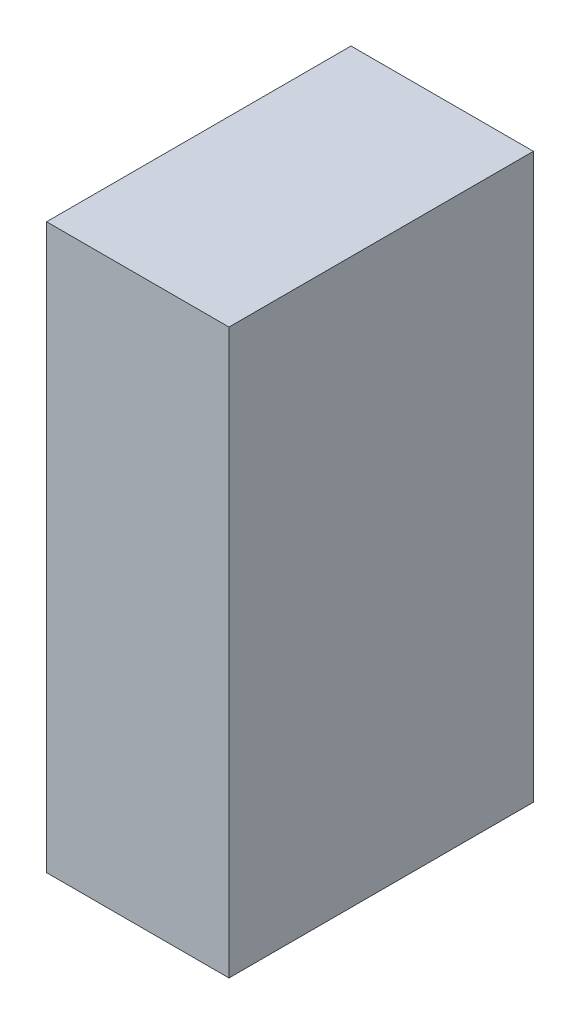
ISO-10303-21;
HEADER;
FILE_DESCRIPTION(('STEP AP214'),'2;1');
FILE_NAME('part.step','',(''),(''),'','','');
FILE_SCHEMA(('AUTOMOTIVE_DESIGN { 1 0 10303 214 1 1 1 1 }'));
ENDSEC;
DATA;
#1=APPLICATION_CONTEXT('core data for automotive mechanical design processes');
#2=APPLICATION_PROTOCOL_DEFINITION('international standard','automotive_design',2000,#1);
#3=PRODUCT_CONTEXT('',#1,'mechanical');
#4=PRODUCT('Part','Part','',(#3));
#5=PRODUCT_RELATED_PRODUCT_CATEGORY('part','',(#4));
#6=PRODUCT_DEFINITION_FORMATION('','',#4);
#7=PRODUCT_DEFINITION_CONTEXT('part definition',#1,'design');
#8=PRODUCT_DEFINITION('design','',#6,#7);
#9=PRODUCT_DEFINITION_SHAPE('','',#8);
#10=(LENGTH_UNIT() NAMED_UNIT(*) SI_UNIT(.MILLI.,.METRE.));
#11=(NAMED_UNIT(*) PLANE_ANGLE_UNIT() SI_UNIT($,.RADIAN.));
#12=(NAMED_UNIT(*) SI_UNIT($,.STERADIAN.) SOLID_ANGLE_UNIT());
#13=UNCERTAINTY_MEASURE_WITH_UNIT(LENGTH_MEASURE(1.E-05),#10,'distance_accuracy_value','');
#14=(GEOMETRIC_REPRESENTATION_CONTEXT(3) GLOBAL_UNCERTAINTY_ASSIGNED_CONTEXT((#13)) GLOBAL_UNIT_ASSIGNED_CONTEXT((#10,
#11,#12)) REPRESENTATION_CONTEXT('',''));
#15=CARTESIAN_POINT('',(0.,0.,0.));
#16=DIRECTION('',(0.,0.,1.));
#17=DIRECTION('',(1.,0.,0.));
#18=AXIS2_PLACEMENT_3D('',#15,#16,#17);
#19=CARTESIAN_POINT('',(-0.13750036,0.42500042,0.45899832));
#20=DIRECTION('',(0.,0.,-1.));
#21=DIRECTION('',(0.,-1.,0.));
#22=AXIS2_PLACEMENT_3D('',#19,#20,#21);
#23=PLANE('',#22);
#24=DIRECTION('',(0.,-1.,0.));
#25=VECTOR('',#24,1.);
#26=CARTESIAN_POINT('',(-0.13750036,0.42500042,0.45899832));
#27=LINE('',#26,#25);
#28=CARTESIAN_POINT('',(-0.13750036,0.42500042,0.45899832));
#29=VERTEX_POINT('',#28);
#30=CARTESIAN_POINT('',(-0.13750036,-0.42500042,0.45899832));
#31=VERTEX_POINT('',#30);
#32=EDGE_CURVE('E82',#29,#31,#27,.T.);
#33=ORIENTED_EDGE('',*,*,#32,.T.);
#34=DIRECTION('',(1.,0.,0.));
#35=VECTOR('',#34,1.);
#36=CARTESIAN_POINT('',(-0.13750036,-0.42500042,0.45899832));
#37=LINE('',#36,#35);
#38=CARTESIAN_POINT('',(0.13750036,-0.42500042,0.45899832));
#39=VERTEX_POINT('',#38);
#40=EDGE_CURVE('E88',#31,#39,#37,.T.);
#41=ORIENTED_EDGE('',*,*,#40,.T.);
#42=DIRECTION('',(0.,1.,0.));
#43=VECTOR('',#42,1.);
#44=CARTESIAN_POINT('',(0.13750036,-0.42500042,0.45899832));
#45=LINE('',#44,#43);
#46=CARTESIAN_POINT('',(0.13750036,0.42500042,0.45899832));
#47=VERTEX_POINT('',#46);
#48=EDGE_CURVE('E106',#39,#47,#45,.T.);
#49=ORIENTED_EDGE('',*,*,#48,.T.);
#50=DIRECTION('',(-1.,0.,0.));
#51=VECTOR('',#50,1.);
#52=CARTESIAN_POINT('',(0.13750036,0.42500042,0.45899832));
#53=LINE('',#52,#51);
#54=EDGE_CURVE('E11',#47,#29,#53,.T.);
#55=ORIENTED_EDGE('',*,*,#54,.T.);
#56=EDGE_LOOP('',(#33,#41,#49,#55));
#57=FACE_BOUND('',#56,.T.);
#58=ADVANCED_FACE('F17',(#57),#23,.F.);
#59=CARTESIAN_POINT('',(-0.13750036,0.42500042,0.));
#60=DIRECTION('',(0.,0.,-1.));
#61=DIRECTION('',(0.,-1.,0.));
#62=AXIS2_PLACEMENT_3D('',#59,#60,#61);
#63=PLANE('',#62);
#64=DIRECTION('',(0.,-1.,0.));
#65=VECTOR('',#64,1.);
#66=CARTESIAN_POINT('',(-0.13750036,0.42500042,0.));
#67=LINE('',#66,#65);
#68=CARTESIAN_POINT('',(-0.13750036,0.42500042,0.));
#69=VERTEX_POINT('',#68);
#70=CARTESIAN_POINT('',(-0.13750036,-0.42500042,0.));
#71=VERTEX_POINT('',#70);
#72=EDGE_CURVE('E73',#69,#71,#67,.T.);
#73=ORIENTED_EDGE('',*,*,#72,.F.);
#74=DIRECTION('',(-1.,0.,0.));
#75=VECTOR('',#74,1.);
#76=CARTESIAN_POINT('',(0.13750036,0.42500042,0.));
#77=LINE('',#76,#75);
#78=CARTESIAN_POINT('',(0.13750036,0.42500042,0.));
#79=VERTEX_POINT('',#78);
#80=EDGE_CURVE('E27',#79,#69,#77,.T.);
#81=ORIENTED_EDGE('',*,*,#80,.F.);
#82=DIRECTION('',(0.,1.,0.));
#83=VECTOR('',#82,1.);
#84=CARTESIAN_POINT('',(0.13750036,-0.42500042,0.));
#85=LINE('',#84,#83);
#86=CARTESIAN_POINT('',(0.13750036,-0.42500042,0.));
#87=VERTEX_POINT('',#86);
#88=EDGE_CURVE('E76',#87,#79,#85,.T.);
#89=ORIENTED_EDGE('',*,*,#88,.F.);
#90=DIRECTION('',(1.,0.,0.));
#91=VECTOR('',#90,1.);
#92=CARTESIAN_POINT('',(-0.13750036,-0.42500042,0.));
#93=LINE('',#92,#91);
#94=EDGE_CURVE('E70',#71,#87,#93,.T.);
#95=ORIENTED_EDGE('',*,*,#94,.F.);
#96=EDGE_LOOP('',(#73,#81,#89,#95));
#97=FACE_BOUND('',#96,.T.);
#98=ADVANCED_FACE('F19',(#97),#63,.T.);
#99=CARTESIAN_POINT('',(0.13750036,0.42500042,0.));
#100=DIRECTION('',(0.,-1.,0.));
#101=DIRECTION('',(0.,0.,-1.));
#102=AXIS2_PLACEMENT_3D('',#99,#100,#101);
#103=PLANE('',#102);
#104=DIRECTION('',(0.,0.,1.));
#105=VECTOR('',#104,1.);
#106=CARTESIAN_POINT('',(0.13750036,0.42500042,0.));
#107=LINE('',#106,#105);
#108=EDGE_CURVE('E21',#79,#47,#107,.T.);
#109=ORIENTED_EDGE('',*,*,#108,.F.);
#110=ORIENTED_EDGE('',*,*,#80,.T.);
#111=DIRECTION('',(0.,0.,1.));
#112=VECTOR('',#111,1.);
#113=CARTESIAN_POINT('',(-0.13750036,0.42500042,0.));
#114=LINE('',#113,#112);
#115=EDGE_CURVE('E95',#69,#29,#114,.T.);
#116=ORIENTED_EDGE('',*,*,#115,.T.);
#117=ORIENTED_EDGE('',*,*,#54,.F.);
#118=EDGE_LOOP('',(#109,#110,#116,#117));
#119=FACE_BOUND('',#118,.T.);
#120=ADVANCED_FACE('F123',(#119),#103,.F.);
#121=CARTESIAN_POINT('',(0.13750036,-0.42500042,0.));
#122=DIRECTION('',(-1.,0.,0.));
#123=DIRECTION('',(0.,0.,1.));
#124=AXIS2_PLACEMENT_3D('',#121,#122,#123);
#125=PLANE('',#124);
#126=DIRECTION('',(0.,0.,1.));
#127=VECTOR('',#126,1.);
#128=CARTESIAN_POINT('',(0.13750036,-0.42500042,0.));
#129=LINE('',#128,#127);
#130=EDGE_CURVE('E81',#87,#39,#129,.T.);
#131=ORIENTED_EDGE('',*,*,#130,.F.);
#132=ORIENTED_EDGE('',*,*,#88,.T.);
#133=ORIENTED_EDGE('',*,*,#108,.T.);
#134=ORIENTED_EDGE('',*,*,#48,.F.);
#135=EDGE_LOOP('',(#131,#132,#133,#134));
#136=FACE_BOUND('',#135,.T.);
#137=ADVANCED_FACE('F122',(#136),#125,.F.);
#138=CARTESIAN_POINT('',(-0.13750036,-0.42500042,0.));
#139=DIRECTION('',(0.,1.,0.));
#140=DIRECTION('',(1.,0.,0.));
#141=AXIS2_PLACEMENT_3D('',#138,#139,#140);
#142=PLANE('',#141);
#143=DIRECTION('',(0.,0.,1.));
#144=VECTOR('',#143,1.);
#145=CARTESIAN_POINT('',(-0.13750036,-0.42500042,0.));
#146=LINE('',#145,#144);
#147=EDGE_CURVE('E85',#71,#31,#146,.T.);
#148=ORIENTED_EDGE('',*,*,#147,.F.);
#149=ORIENTED_EDGE('',*,*,#94,.T.);
#150=ORIENTED_EDGE('',*,*,#130,.T.);
#151=ORIENTED_EDGE('',*,*,#40,.F.);
#152=EDGE_LOOP('',(#148,#149,#150,#151));
#153=FACE_BOUND('',#152,.T.);
#154=ADVANCED_FACE('F86',(#153),#142,.F.);
#155=CARTESIAN_POINT('',(-0.13750036,0.42500042,0.));
#156=DIRECTION('',(1.,0.,0.));
#157=DIRECTION('',(0.,1.,0.));
#158=AXIS2_PLACEMENT_3D('',#155,#156,#157);
#159=PLANE('',#158);
#160=ORIENTED_EDGE('',*,*,#115,.F.);
#161=ORIENTED_EDGE('',*,*,#72,.T.);
#162=ORIENTED_EDGE('',*,*,#147,.T.);
#163=ORIENTED_EDGE('',*,*,#32,.F.);
#164=EDGE_LOOP('',(#160,#161,#162,#163));
#165=FACE_BOUND('',#164,.T.);
#166=ADVANCED_FACE('F94',(#165),#159,.F.);
#167=CLOSED_SHELL('',(#58,#98,#120,#137,#154,#166));
#168=MANIFOLD_SOLID_BREP('B1',#167);
#169=ADVANCED_BREP_SHAPE_REPRESENTATION('',(#18,#168),#14);
#170=SHAPE_DEFINITION_REPRESENTATION(#9,#169);
ENDSEC;
END-ISO-10303-21;
